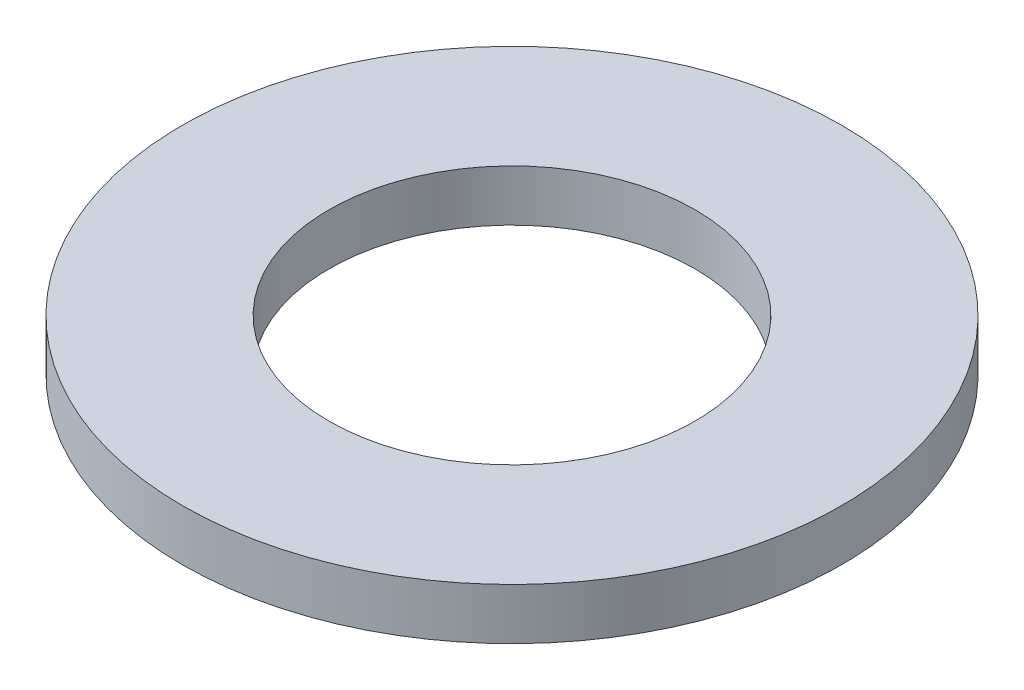
ISO-10303-21;
HEADER;
FILE_DESCRIPTION(('STEP AP214'),'2;1');
FILE_NAME('part.step','',(''),(''),'','','');
FILE_SCHEMA(('AUTOMOTIVE_DESIGN { 1 0 10303 214 1 1 1 1 }'));
ENDSEC;
DATA;
#1=APPLICATION_CONTEXT('core data for automotive mechanical design processes');
#2=APPLICATION_PROTOCOL_DEFINITION('international standard','automotive_design',2000,#1);
#3=PRODUCT_CONTEXT('',#1,'mechanical');
#4=PRODUCT('Part','Part','',(#3));
#5=PRODUCT_RELATED_PRODUCT_CATEGORY('part','',(#4));
#6=PRODUCT_DEFINITION_FORMATION('','',#4);
#7=PRODUCT_DEFINITION_CONTEXT('part definition',#1,'design');
#8=PRODUCT_DEFINITION('design','',#6,#7);
#9=PRODUCT_DEFINITION_SHAPE('','',#8);
#10=(LENGTH_UNIT() NAMED_UNIT(*) SI_UNIT(.MILLI.,.METRE.));
#11=(NAMED_UNIT(*) PLANE_ANGLE_UNIT() SI_UNIT($,.RADIAN.));
#12=(NAMED_UNIT(*) SI_UNIT($,.STERADIAN.) SOLID_ANGLE_UNIT());
#13=UNCERTAINTY_MEASURE_WITH_UNIT(LENGTH_MEASURE(1.E-05),#10,'distance_accuracy_value','');
#14=(GEOMETRIC_REPRESENTATION_CONTEXT(3) GLOBAL_UNCERTAINTY_ASSIGNED_CONTEXT((#13)) GLOBAL_UNIT_ASSIGNED_CONTEXT((#10,
#11,#12)) REPRESENTATION_CONTEXT('',''));
#15=CARTESIAN_POINT('',(0.,0.,0.));
#16=DIRECTION('',(0.,0.,1.));
#17=DIRECTION('',(1.,0.,0.));
#18=AXIS2_PLACEMENT_3D('',#15,#16,#17);
#19=CARTESIAN_POINT('',(0.,14.,0.));
#20=DIRECTION('',(0.,-1.,0.));
#21=DIRECTION('',(0.,0.,-1.));
#22=AXIS2_PLACEMENT_3D('',#19,#20,#21);
#23=CYLINDRICAL_SURFACE('',#22,90.);
#24=CARTESIAN_POINT('',(0.,14.,0.));
#25=DIRECTION('',(0.,1.,0.));
#26=DIRECTION('',(0.,0.,1.));
#27=AXIS2_PLACEMENT_3D('',#24,#25,#26);
#28=CIRCLE('',#27,90.);
#29=CARTESIAN_POINT('',(0.,14.,90.));
#30=VERTEX_POINT('',#29);
#31=EDGE_CURVE('E10',#30,#30,#28,.T.);
#32=ORIENTED_EDGE('',*,*,#31,.F.);
#33=EDGE_LOOP('',(#32));
#34=FACE_BOUND('',#33,.T.);
#35=CARTESIAN_POINT('',(0.,0.,0.));
#36=DIRECTION('',(0.,1.,0.));
#37=DIRECTION('',(0.,0.,1.));
#38=AXIS2_PLACEMENT_3D('',#35,#36,#37);
#39=CIRCLE('',#38,90.);
#40=CARTESIAN_POINT('',(0.,0.,90.));
#41=VERTEX_POINT('',#40);
#42=EDGE_CURVE('E37',#41,#41,#39,.T.);
#43=ORIENTED_EDGE('',*,*,#42,.T.);
#44=EDGE_LOOP('',(#43));
#45=FACE_BOUND('',#44,.T.);
#46=ADVANCED_FACE('F40',(#34,#45),#23,.T.);
#47=CARTESIAN_POINT('',(0.,14.,0.));
#48=DIRECTION('',(0.,1.,0.));
#49=DIRECTION('',(0.,0.,1.));
#50=AXIS2_PLACEMENT_3D('',#47,#48,#49);
#51=PLANE('',#50);
#52=CARTESIAN_POINT('',(0.,14.,0.));
#53=DIRECTION('',(0.,1.,0.));
#54=DIRECTION('',(0.,0.,1.));
#55=AXIS2_PLACEMENT_3D('',#52,#53,#54);
#56=CIRCLE('',#55,50.);
#57=CARTESIAN_POINT('',(0.,14.,50.));
#58=VERTEX_POINT('',#57);
#59=EDGE_CURVE('E50',#58,#58,#56,.T.);
#60=ORIENTED_EDGE('',*,*,#59,.F.);
#61=EDGE_LOOP('',(#60));
#62=FACE_BOUND('',#61,.T.);
#63=ORIENTED_EDGE('',*,*,#31,.T.);
#64=EDGE_LOOP('',(#63));
#65=FACE_BOUND('',#64,.T.);
#66=ADVANCED_FACE('F59',(#62,#65),#51,.T.);
#67=CARTESIAN_POINT('',(0.,0.,0.));
#68=DIRECTION('',(0.,1.,0.));
#69=DIRECTION('',(0.,0.,1.));
#70=AXIS2_PLACEMENT_3D('',#67,#68,#69);
#71=PLANE('',#70);
#72=CARTESIAN_POINT('',(0.,0.,0.));
#73=DIRECTION('',(0.,1.,0.));
#74=DIRECTION('',(0.,0.,1.));
#75=AXIS2_PLACEMENT_3D('',#72,#73,#74);
#76=CIRCLE('',#75,50.);
#77=CARTESIAN_POINT('',(0.,0.,50.));
#78=VERTEX_POINT('',#77);
#79=EDGE_CURVE('E47',#78,#78,#76,.T.);
#80=ORIENTED_EDGE('',*,*,#79,.T.);
#81=EDGE_LOOP('',(#80));
#82=FACE_BOUND('',#81,.T.);
#83=ORIENTED_EDGE('',*,*,#42,.F.);
#84=EDGE_LOOP('',(#83));
#85=FACE_BOUND('',#84,.T.);
#86=ADVANCED_FACE('F58',(#82,#85),#71,.F.);
#87=CARTESIAN_POINT('',(0.,14.,0.));
#88=DIRECTION('',(0.,-1.,0.));
#89=DIRECTION('',(0.,0.,-1.));
#90=AXIS2_PLACEMENT_3D('',#87,#88,#89);
#91=CYLINDRICAL_SURFACE('',#90,50.);
#92=ORIENTED_EDGE('',*,*,#59,.T.);
#93=EDGE_LOOP('',(#92));
#94=FACE_BOUND('',#93,.T.);
#95=ORIENTED_EDGE('',*,*,#79,.F.);
#96=EDGE_LOOP('',(#95));
#97=FACE_BOUND('',#96,.T.);
#98=ADVANCED_FACE('F54',(#94,#97),#91,.F.);
#99=CLOSED_SHELL('',(#46,#66,#86,#98));
#100=MANIFOLD_SOLID_BREP('B2',#99);
#101=ADVANCED_BREP_SHAPE_REPRESENTATION('',(#18,#100),#14);
#102=SHAPE_DEFINITION_REPRESENTATION(#9,#101);
ENDSEC;
END-ISO-10303-21;
